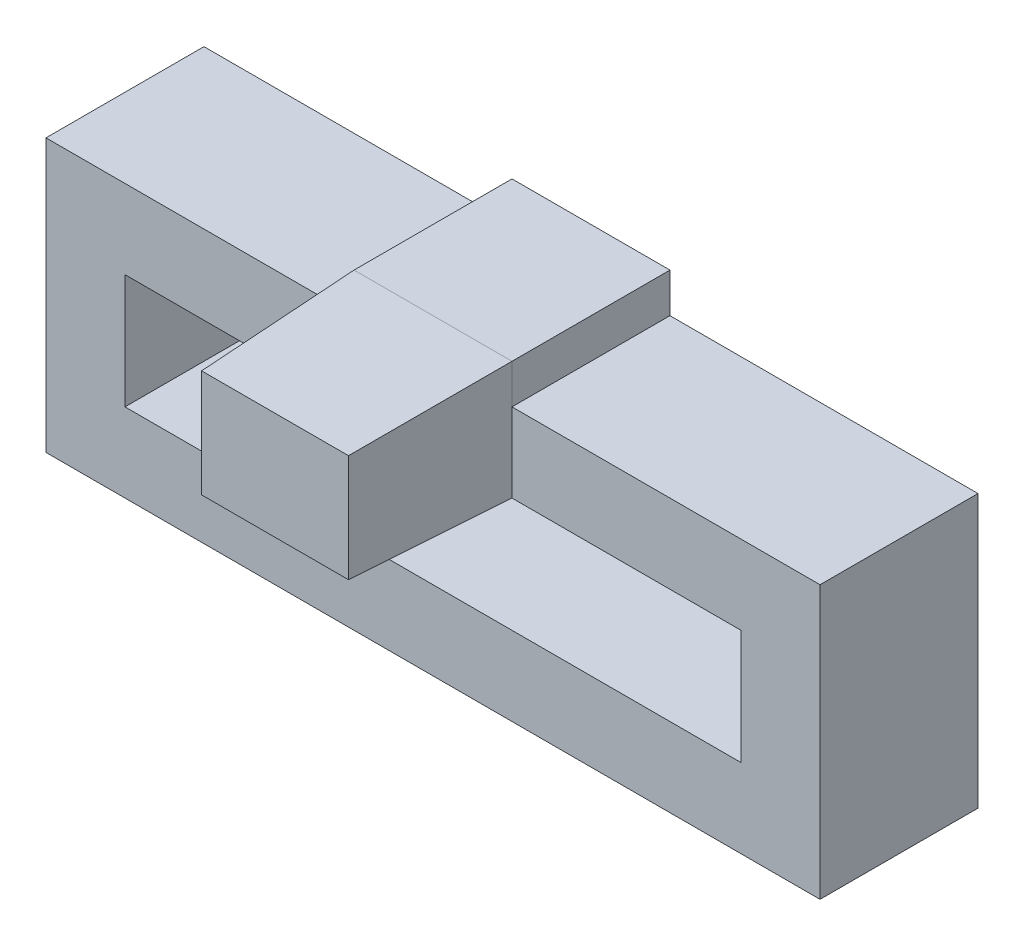
ISO-10303-21;
HEADER;
FILE_DESCRIPTION(('STEP AP214'),'2;1');
FILE_NAME('part.step','',(''),(''),'','','');
FILE_SCHEMA(('AUTOMOTIVE_DESIGN { 1 0 10303 214 1 1 1 1 }'));
ENDSEC;
DATA;
#1=APPLICATION_CONTEXT('core data for automotive mechanical design processes');
#2=APPLICATION_PROTOCOL_DEFINITION('international standard','automotive_design',2000,#1);
#3=PRODUCT_CONTEXT('',#1,'mechanical');
#4=PRODUCT('Part','Part','',(#3));
#5=PRODUCT_RELATED_PRODUCT_CATEGORY('part','',(#4));
#6=PRODUCT_DEFINITION_FORMATION('','',#4);
#7=PRODUCT_DEFINITION_CONTEXT('part definition',#1,'design');
#8=PRODUCT_DEFINITION('design','',#6,#7);
#9=PRODUCT_DEFINITION_SHAPE('','',#8);
#10=(LENGTH_UNIT() NAMED_UNIT(*) SI_UNIT(.MILLI.,.METRE.));
#11=(NAMED_UNIT(*) PLANE_ANGLE_UNIT() SI_UNIT($,.RADIAN.));
#12=(NAMED_UNIT(*) SI_UNIT($,.STERADIAN.) SOLID_ANGLE_UNIT());
#13=UNCERTAINTY_MEASURE_WITH_UNIT(LENGTH_MEASURE(1.E-05),#10,'distance_accuracy_value','');
#14=(GEOMETRIC_REPRESENTATION_CONTEXT(3) GLOBAL_UNCERTAINTY_ASSIGNED_CONTEXT((#13)) GLOBAL_UNIT_ASSIGNED_CONTEXT((#10,
#11,#12)) REPRESENTATION_CONTEXT('',''));
#15=CARTESIAN_POINT('',(0.,0.,0.));
#16=DIRECTION('',(0.,0.,1.));
#17=DIRECTION('',(1.,0.,0.));
#18=AXIS2_PLACEMENT_3D('',#15,#16,#17);
#19=CARTESIAN_POINT('',(0.,4.9,4.));
#20=DIRECTION('',(0.,-1.,0.));
#21=DIRECTION('',(0.,0.,-1.));
#22=AXIS2_PLACEMENT_3D('',#19,#20,#21);
#23=PLANE('',#22);
#24=DIRECTION('',(0.,0.,1.));
#25=VECTOR('',#24,1.);
#26=CARTESIAN_POINT('',(5.8,4.9,4.));
#27=LINE('',#26,#25);
#28=CARTESIAN_POINT('',(5.8,4.9,0.));
#29=VERTEX_POINT('',#28);
#30=CARTESIAN_POINT('',(5.8,4.9,4.));
#31=VERTEX_POINT('',#30);
#32=EDGE_CURVE('E221',#29,#31,#27,.T.);
#33=ORIENTED_EDGE('',*,*,#32,.F.);
#34=DIRECTION('',(-1.,0.,0.));
#35=VECTOR('',#34,1.);
#36=CARTESIAN_POINT('',(0.,4.9,0.));
#37=LINE('',#36,#35);
#38=CARTESIAN_POINT('',(-2.,4.9,0.));
#39=VERTEX_POINT('',#38);
#40=EDGE_CURVE('E275',#29,#39,#37,.T.);
#41=ORIENTED_EDGE('',*,*,#40,.T.);
#42=DIRECTION('',(0.,0.,-1.));
#43=VECTOR('',#42,1.);
#44=CARTESIAN_POINT('',(-2.,4.9,4.));
#45=LINE('',#44,#43);
#46=CARTESIAN_POINT('',(-2.,4.9,4.));
#47=VERTEX_POINT('',#46);
#48=EDGE_CURVE('E268',#47,#39,#45,.T.);
#49=ORIENTED_EDGE('',*,*,#48,.F.);
#50=DIRECTION('',(-1.,0.,0.));
#51=VECTOR('',#50,1.);
#52=CARTESIAN_POINT('',(0.,4.9,4.));
#53=LINE('',#52,#51);
#54=EDGE_CURVE('E264',#31,#47,#53,.T.);
#55=ORIENTED_EDGE('',*,*,#54,.F.);
#56=EDGE_LOOP('',(#33,#41,#49,#55));
#57=FACE_BOUND('',#56,.T.);
#58=ADVANCED_FACE('F63',(#57),#23,.F.);
#59=DIRECTION('',(0.,0.,-1.));
#60=VECTOR('',#59,1.);
#61=CARTESIAN_POINT('',(9.8,4.9,4.));
#62=LINE('',#61,#60);
#63=CARTESIAN_POINT('',(9.8,4.9,4.));
#64=VERTEX_POINT('',#63);
#65=CARTESIAN_POINT('',(9.8,4.9,0.));
#66=VERTEX_POINT('',#65);
#67=EDGE_CURVE('E204',#64,#66,#62,.T.);
#68=ORIENTED_EDGE('',*,*,#67,.F.);
#69=CARTESIAN_POINT('',(17.6,4.9,4.));
#70=VERTEX_POINT('',#69);
#71=EDGE_CURVE('E265',#70,#64,#53,.T.);
#72=ORIENTED_EDGE('',*,*,#71,.F.);
#73=DIRECTION('',(0.,0.,-1.));
#74=VECTOR('',#73,1.);
#75=CARTESIAN_POINT('',(17.6,4.9,4.));
#76=LINE('',#75,#74);
#77=CARTESIAN_POINT('',(17.6,4.9,0.));
#78=VERTEX_POINT('',#77);
#79=EDGE_CURVE('E279',#70,#78,#76,.T.);
#80=ORIENTED_EDGE('',*,*,#79,.T.);
#81=EDGE_CURVE('E88',#78,#66,#37,.T.);
#82=ORIENTED_EDGE('',*,*,#81,.T.);
#83=EDGE_LOOP('',(#68,#72,#80,#82));
#84=FACE_BOUND('',#83,.T.);
#85=ADVANCED_FACE('F329',(#84),#23,.F.);
#86=CARTESIAN_POINT('',(0.,0.,4.));
#87=DIRECTION('',(0.,0.,1.));
#88=DIRECTION('',(1.,0.,0.));
#89=AXIS2_PLACEMENT_3D('',#86,#87,#88);
#90=PLANE('',#89);
#91=DIRECTION('',(0.,-1.,0.));
#92=VECTOR('',#91,1.);
#93=CARTESIAN_POINT('',(5.8,5.9,4.));
#94=LINE('',#93,#92);
#95=CARTESIAN_POINT('',(5.8,2.9,4.));
#96=VERTEX_POINT('',#95);
#97=EDGE_CURVE('E12',#31,#96,#94,.T.);
#98=ORIENTED_EDGE('',*,*,#97,.F.);
#99=ORIENTED_EDGE('',*,*,#54,.T.);
#100=DIRECTION('',(0.,-1.,0.));
#101=VECTOR('',#100,1.);
#102=CARTESIAN_POINT('',(-2.,0.,4.));
#103=LINE('',#102,#101);
#104=CARTESIAN_POINT('',(-2.,-2.,4.));
#105=VERTEX_POINT('',#104);
#106=EDGE_CURVE('E257',#47,#105,#103,.T.);
#107=ORIENTED_EDGE('',*,*,#106,.T.);
#108=DIRECTION('',(1.,0.,0.));
#109=VECTOR('',#108,1.);
#110=CARTESIAN_POINT('',(0.,-2.,4.));
#111=LINE('',#110,#109);
#112=CARTESIAN_POINT('',(17.6,-2.,4.));
#113=VERTEX_POINT('',#112);
#114=EDGE_CURVE('E260',#105,#113,#111,.T.);
#115=ORIENTED_EDGE('',*,*,#114,.T.);
#116=DIRECTION('',(0.,1.,0.));
#117=VECTOR('',#116,1.);
#118=CARTESIAN_POINT('',(17.6,0.,4.));
#119=LINE('',#118,#117);
#120=EDGE_CURVE('E262',#113,#70,#119,.T.);
#121=ORIENTED_EDGE('',*,*,#120,.T.);
#122=ORIENTED_EDGE('',*,*,#71,.T.);
#123=DIRECTION('',(0.,-1.,0.));
#124=VECTOR('',#123,1.);
#125=CARTESIAN_POINT('',(9.8,5.9,4.));
#126=LINE('',#125,#124);
#127=CARTESIAN_POINT('',(9.8,2.9,4.));
#128=VERTEX_POINT('',#127);
#129=EDGE_CURVE('E72',#64,#128,#126,.T.);
#130=ORIENTED_EDGE('',*,*,#129,.T.);
#131=DIRECTION('',(-1.,0.,0.));
#132=VECTOR('',#131,1.);
#133=CARTESIAN_POINT('',(0.,2.9,4.));
#134=LINE('',#133,#132);
#135=CARTESIAN_POINT('',(15.6,2.9,4.));
#136=VERTEX_POINT('',#135);
#137=EDGE_CURVE('E234',#136,#128,#134,.T.);
#138=ORIENTED_EDGE('',*,*,#137,.F.);
#139=DIRECTION('',(0.,1.,0.));
#140=VECTOR('',#139,1.);
#141=CARTESIAN_POINT('',(15.6,0.,4.));
#142=LINE('',#141,#140);
#143=CARTESIAN_POINT('',(15.6,0.,4.));
#144=VERTEX_POINT('',#143);
#145=EDGE_CURVE('E230',#144,#136,#142,.T.);
#146=ORIENTED_EDGE('',*,*,#145,.F.);
#147=DIRECTION('',(1.,0.,0.));
#148=VECTOR('',#147,1.);
#149=CARTESIAN_POINT('',(0.,0.,4.));
#150=LINE('',#149,#148);
#151=CARTESIAN_POINT('',(0.,0.,4.));
#152=VERTEX_POINT('',#151);
#153=EDGE_CURVE('E227',#152,#144,#150,.T.);
#154=ORIENTED_EDGE('',*,*,#153,.F.);
#155=DIRECTION('',(0.,-1.,0.));
#156=VECTOR('',#155,1.);
#157=CARTESIAN_POINT('',(0.,0.,4.));
#158=LINE('',#157,#156);
#159=CARTESIAN_POINT('',(0.,2.9,4.));
#160=VERTEX_POINT('',#159);
#161=EDGE_CURVE('E225',#160,#152,#158,.T.);
#162=ORIENTED_EDGE('',*,*,#161,.F.);
#163=EDGE_CURVE('E233',#96,#160,#134,.T.);
#164=ORIENTED_EDGE('',*,*,#163,.F.);
#165=EDGE_LOOP('',(#98,#99,#107,#115,#121,#122,#130,#138,#146,#154,#162,#164));
#166=FACE_BOUND('',#165,.T.);
#167=ADVANCED_FACE('F312',(#166),#90,.T.);
#168=CARTESIAN_POINT('',(0.,0.,0.));
#169=DIRECTION('',(0.,0.,1.));
#170=DIRECTION('',(1.,0.,0.));
#171=AXIS2_PLACEMENT_3D('',#168,#169,#170);
#172=PLANE('',#171);
#173=ORIENTED_EDGE('',*,*,#40,.F.);
#174=DIRECTION('',(0.,-1.,0.));
#175=VECTOR('',#174,1.);
#176=CARTESIAN_POINT('',(5.8,2.9,0.));
#177=LINE('',#176,#175);
#178=CARTESIAN_POINT('',(5.8,5.9,0.));
#179=VERTEX_POINT('',#178);
#180=EDGE_CURVE('E214',#179,#29,#177,.T.);
#181=ORIENTED_EDGE('',*,*,#180,.F.);
#182=DIRECTION('',(-1.,0.,0.));
#183=VECTOR('',#182,1.);
#184=CARTESIAN_POINT('',(5.8,5.9,0.));
#185=LINE('',#184,#183);
#186=CARTESIAN_POINT('',(9.8,5.9,0.));
#187=VERTEX_POINT('',#186);
#188=EDGE_CURVE('E218',#187,#179,#185,.T.);
#189=ORIENTED_EDGE('',*,*,#188,.F.);
#190=DIRECTION('',(0.,1.,0.));
#191=VECTOR('',#190,1.);
#192=CARTESIAN_POINT('',(9.8,2.9,0.));
#193=LINE('',#192,#191);
#194=EDGE_CURVE('E201',#66,#187,#193,.T.);
#195=ORIENTED_EDGE('',*,*,#194,.F.);
#196=ORIENTED_EDGE('',*,*,#81,.F.);
#197=DIRECTION('',(0.,1.,0.));
#198=VECTOR('',#197,1.);
#199=CARTESIAN_POINT('',(17.6,0.,0.));
#200=LINE('',#199,#198);
#201=CARTESIAN_POINT('',(17.6,-2.,0.));
#202=VERTEX_POINT('',#201);
#203=EDGE_CURVE('E273',#202,#78,#200,.T.);
#204=ORIENTED_EDGE('',*,*,#203,.F.);
#205=DIRECTION('',(1.,0.,0.));
#206=VECTOR('',#205,1.);
#207=CARTESIAN_POINT('',(0.,-2.,0.));
#208=LINE('',#207,#206);
#209=CARTESIAN_POINT('',(-2.,-2.,0.));
#210=VERTEX_POINT('',#209);
#211=EDGE_CURVE('E271',#210,#202,#208,.T.);
#212=ORIENTED_EDGE('',*,*,#211,.F.);
#213=DIRECTION('',(0.,-1.,0.));
#214=VECTOR('',#213,1.);
#215=CARTESIAN_POINT('',(-2.,0.,0.));
#216=LINE('',#215,#214);
#217=EDGE_CURVE('E256',#39,#210,#216,.T.);
#218=ORIENTED_EDGE('',*,*,#217,.F.);
#219=EDGE_LOOP('',(#173,#181,#189,#195,#196,#204,#212,#218));
#220=FACE_BOUND('',#219,.T.);
#221=DIRECTION('',(-1.,0.,0.));
#222=VECTOR('',#221,1.);
#223=CARTESIAN_POINT('',(0.,2.9,0.));
#224=LINE('',#223,#222);
#225=CARTESIAN_POINT('',(15.6,2.9,0.));
#226=VERTEX_POINT('',#225);
#227=CARTESIAN_POINT('',(0.,2.9,0.));
#228=VERTEX_POINT('',#227);
#229=EDGE_CURVE('E228',#226,#228,#224,.T.);
#230=ORIENTED_EDGE('',*,*,#229,.T.);
#231=DIRECTION('',(0.,-1.,0.));
#232=VECTOR('',#231,1.);
#233=CARTESIAN_POINT('',(0.,0.,0.));
#234=LINE('',#233,#232);
#235=CARTESIAN_POINT('',(0.,0.,0.));
#236=VERTEX_POINT('',#235);
#237=EDGE_CURVE('E224',#228,#236,#234,.T.);
#238=ORIENTED_EDGE('',*,*,#237,.T.);
#239=DIRECTION('',(1.,0.,0.));
#240=VECTOR('',#239,1.);
#241=CARTESIAN_POINT('',(0.,0.,0.));
#242=LINE('',#241,#240);
#243=CARTESIAN_POINT('',(15.6,0.,0.));
#244=VERTEX_POINT('',#243);
#245=EDGE_CURVE('E240',#236,#244,#242,.T.);
#246=ORIENTED_EDGE('',*,*,#245,.T.);
#247=DIRECTION('',(0.,1.,0.));
#248=VECTOR('',#247,1.);
#249=CARTESIAN_POINT('',(15.6,0.,0.));
#250=LINE('',#249,#248);
#251=EDGE_CURVE('E243',#244,#226,#250,.T.);
#252=ORIENTED_EDGE('',*,*,#251,.T.);
#253=EDGE_LOOP('',(#230,#238,#246,#252));
#254=FACE_BOUND('',#253,.T.);
#255=ADVANCED_FACE('F321',(#220,#254),#172,.F.);
#256=CARTESIAN_POINT('',(-2.,0.,4.));
#257=DIRECTION('',(1.,0.,0.));
#258=DIRECTION('',(0.,0.,-1.));
#259=AXIS2_PLACEMENT_3D('',#256,#257,#258);
#260=PLANE('',#259);
#261=ORIENTED_EDGE('',*,*,#217,.T.);
#262=DIRECTION('',(0.,0.,-1.));
#263=VECTOR('',#262,1.);
#264=CARTESIAN_POINT('',(-2.,-2.,4.));
#265=LINE('',#264,#263);
#266=EDGE_CURVE('E67',#105,#210,#265,.T.);
#267=ORIENTED_EDGE('',*,*,#266,.F.);
#268=ORIENTED_EDGE('',*,*,#106,.F.);
#269=ORIENTED_EDGE('',*,*,#48,.T.);
#270=EDGE_LOOP('',(#261,#267,#268,#269));
#271=FACE_BOUND('',#270,.T.);
#272=ADVANCED_FACE('F65',(#271),#260,.F.);
#273=CARTESIAN_POINT('',(0.,-2.,4.));
#274=DIRECTION('',(0.,1.,0.));
#275=DIRECTION('',(0.,0.,1.));
#276=AXIS2_PLACEMENT_3D('',#273,#274,#275);
#277=PLANE('',#276);
#278=ORIENTED_EDGE('',*,*,#211,.T.);
#279=DIRECTION('',(0.,0.,-1.));
#280=VECTOR('',#279,1.);
#281=CARTESIAN_POINT('',(17.6,-2.,4.));
#282=LINE('',#281,#280);
#283=EDGE_CURVE('E280',#113,#202,#282,.T.);
#284=ORIENTED_EDGE('',*,*,#283,.F.);
#285=ORIENTED_EDGE('',*,*,#114,.F.);
#286=ORIENTED_EDGE('',*,*,#266,.T.);
#287=EDGE_LOOP('',(#278,#284,#285,#286));
#288=FACE_BOUND('',#287,.T.);
#289=ADVANCED_FACE('F326',(#288),#277,.F.);
#290=CARTESIAN_POINT('',(17.6,0.,4.));
#291=DIRECTION('',(-1.,0.,0.));
#292=DIRECTION('',(0.,0.,1.));
#293=AXIS2_PLACEMENT_3D('',#290,#291,#292);
#294=PLANE('',#293);
#295=ORIENTED_EDGE('',*,*,#203,.T.);
#296=ORIENTED_EDGE('',*,*,#79,.F.);
#297=ORIENTED_EDGE('',*,*,#120,.F.);
#298=ORIENTED_EDGE('',*,*,#283,.T.);
#299=EDGE_LOOP('',(#295,#296,#297,#298));
#300=FACE_BOUND('',#299,.T.);
#301=ADVANCED_FACE('F327',(#300),#294,.F.);
#302=CARTESIAN_POINT('',(0.,0.,4.));
#303=DIRECTION('',(1.,0.,0.));
#304=DIRECTION('',(0.,0.,-1.));
#305=AXIS2_PLACEMENT_3D('',#302,#303,#304);
#306=PLANE('',#305);
#307=ORIENTED_EDGE('',*,*,#237,.F.);
#308=DIRECTION('',(0.,0.,-1.));
#309=VECTOR('',#308,1.);
#310=CARTESIAN_POINT('',(0.,2.9,4.));
#311=LINE('',#310,#309);
#312=EDGE_CURVE('E237',#160,#228,#311,.T.);
#313=ORIENTED_EDGE('',*,*,#312,.F.);
#314=ORIENTED_EDGE('',*,*,#161,.T.);
#315=DIRECTION('',(0.,0.,-1.));
#316=VECTOR('',#315,1.);
#317=CARTESIAN_POINT('',(0.,0.,4.));
#318=LINE('',#317,#316);
#319=EDGE_CURVE('E253',#152,#236,#318,.T.);
#320=ORIENTED_EDGE('',*,*,#319,.T.);
#321=EDGE_LOOP('',(#307,#313,#314,#320));
#322=FACE_BOUND('',#321,.T.);
#323=ADVANCED_FACE('F340',(#322),#306,.T.);
#324=CARTESIAN_POINT('',(0.,0.,4.));
#325=DIRECTION('',(0.,1.,0.));
#326=DIRECTION('',(0.,0.,1.));
#327=AXIS2_PLACEMENT_3D('',#324,#325,#326);
#328=PLANE('',#327);
#329=ORIENTED_EDGE('',*,*,#245,.F.);
#330=ORIENTED_EDGE('',*,*,#319,.F.);
#331=ORIENTED_EDGE('',*,*,#153,.T.);
#332=DIRECTION('',(0.,0.,-1.));
#333=VECTOR('',#332,1.);
#334=CARTESIAN_POINT('',(15.6,0.,4.));
#335=LINE('',#334,#333);
#336=EDGE_CURVE('E251',#144,#244,#335,.T.);
#337=ORIENTED_EDGE('',*,*,#336,.T.);
#338=EDGE_LOOP('',(#329,#330,#331,#337));
#339=FACE_BOUND('',#338,.T.);
#340=ADVANCED_FACE('F446',(#339),#328,.T.);
#341=CARTESIAN_POINT('',(15.6,0.,4.));
#342=DIRECTION('',(-1.,0.,0.));
#343=DIRECTION('',(0.,0.,1.));
#344=AXIS2_PLACEMENT_3D('',#341,#342,#343);
#345=PLANE('',#344);
#346=ORIENTED_EDGE('',*,*,#251,.F.);
#347=ORIENTED_EDGE('',*,*,#336,.F.);
#348=ORIENTED_EDGE('',*,*,#145,.T.);
#349=DIRECTION('',(0.,0.,-1.));
#350=VECTOR('',#349,1.);
#351=CARTESIAN_POINT('',(15.6,2.9,4.));
#352=LINE('',#351,#350);
#353=EDGE_CURVE('E249',#136,#226,#352,.T.);
#354=ORIENTED_EDGE('',*,*,#353,.T.);
#355=EDGE_LOOP('',(#346,#347,#348,#354));
#356=FACE_BOUND('',#355,.T.);
#357=ADVANCED_FACE('F370',(#356),#345,.T.);
#358=CARTESIAN_POINT('',(0.,2.9,4.));
#359=DIRECTION('',(0.,-1.,0.));
#360=DIRECTION('',(0.,0.,-1.));
#361=AXIS2_PLACEMENT_3D('',#358,#359,#360);
#362=PLANE('',#361);
#363=ORIENTED_EDGE('',*,*,#137,.T.);
#364=DIRECTION('',(1.,0.,0.));
#365=VECTOR('',#364,1.);
#366=CARTESIAN_POINT('',(5.8,2.9,4.));
#367=LINE('',#366,#365);
#368=EDGE_CURVE('E80',#96,#128,#367,.T.);
#369=ORIENTED_EDGE('',*,*,#368,.F.);
#370=ORIENTED_EDGE('',*,*,#163,.T.);
#371=ORIENTED_EDGE('',*,*,#312,.T.);
#372=ORIENTED_EDGE('',*,*,#229,.F.);
#373=ORIENTED_EDGE('',*,*,#353,.F.);
#374=EDGE_LOOP('',(#363,#369,#370,#371,#372,#373));
#375=FACE_BOUND('',#374,.T.);
#376=ADVANCED_FACE('F365',(#375),#362,.T.);
#377=CARTESIAN_POINT('',(5.8,2.9,4.));
#378=DIRECTION('',(1.,0.,0.));
#379=DIRECTION('',(0.,0.,-1.));
#380=AXIS2_PLACEMENT_3D('',#377,#378,#379);
#381=PLANE('',#380);
#382=ORIENTED_EDGE('',*,*,#180,.T.);
#383=ORIENTED_EDGE('',*,*,#32,.T.);
#384=DIRECTION('',(0.,-1.,0.));
#385=VECTOR('',#384,1.);
#386=CARTESIAN_POINT('',(5.8,2.9,4.));
#387=LINE('',#386,#385);
#388=CARTESIAN_POINT('',(5.8,5.9,4.));
#389=VERTEX_POINT('',#388);
#390=EDGE_CURVE('E195',#389,#31,#387,.T.);
#391=ORIENTED_EDGE('',*,*,#390,.F.);
#392=DIRECTION('',(0.,0.,-1.));
#393=VECTOR('',#392,1.);
#394=CARTESIAN_POINT('',(5.8,5.9,4.));
#395=LINE('',#394,#393);
#396=EDGE_CURVE('E205',#389,#179,#395,.T.);
#397=ORIENTED_EDGE('',*,*,#396,.T.);
#398=EDGE_LOOP('',(#382,#383,#391,#397));
#399=FACE_BOUND('',#398,.T.);
#400=ADVANCED_FACE('F318',(#399),#381,.F.);
#401=CARTESIAN_POINT('',(9.8,2.9,4.));
#402=DIRECTION('',(-1.,0.,0.));
#403=DIRECTION('',(0.,-1.,0.));
#404=AXIS2_PLACEMENT_3D('',#401,#402,#403);
#405=PLANE('',#404);
#406=DIRECTION('',(0.,1.,0.));
#407=VECTOR('',#406,1.);
#408=CARTESIAN_POINT('',(9.8,2.9,4.));
#409=LINE('',#408,#407);
#410=CARTESIAN_POINT('',(9.8,5.9,4.));
#411=VERTEX_POINT('',#410);
#412=EDGE_CURVE('E190',#64,#411,#409,.T.);
#413=ORIENTED_EDGE('',*,*,#412,.F.);
#414=ORIENTED_EDGE('',*,*,#67,.T.);
#415=ORIENTED_EDGE('',*,*,#194,.T.);
#416=DIRECTION('',(0.,0.,-1.));
#417=VECTOR('',#416,1.);
#418=CARTESIAN_POINT('',(9.8,5.9,4.));
#419=LINE('',#418,#417);
#420=EDGE_CURVE('E198',#411,#187,#419,.T.);
#421=ORIENTED_EDGE('',*,*,#420,.F.);
#422=EDGE_LOOP('',(#413,#414,#415,#421));
#423=FACE_BOUND('',#422,.T.);
#424=ADVANCED_FACE('F199',(#423),#405,.F.);
#425=CARTESIAN_POINT('',(5.8,5.9,4.));
#426=DIRECTION('',(0.,-1.,0.));
#427=DIRECTION('',(1.,0.,0.));
#428=AXIS2_PLACEMENT_3D('',#425,#426,#427);
#429=PLANE('',#428);
#430=ORIENTED_EDGE('',*,*,#188,.T.);
#431=ORIENTED_EDGE('',*,*,#396,.F.);
#432=DIRECTION('',(-1.,0.,0.));
#433=VECTOR('',#432,1.);
#434=CARTESIAN_POINT('',(5.8,5.9,4.));
#435=LINE('',#434,#433);
#436=EDGE_CURVE('E179',#411,#389,#435,.T.);
#437=ORIENTED_EDGE('',*,*,#436,.F.);
#438=ORIENTED_EDGE('',*,*,#420,.T.);
#439=EDGE_LOOP('',(#430,#431,#437,#438));
#440=FACE_BOUND('',#439,.T.);
#441=ADVANCED_FACE('F207',(#440),#429,.F.);
#442=CARTESIAN_POINT('',(5.8,2.9,4.));
#443=DIRECTION('',(0.,-0.999390827019096,0.034899496702501));
#444=DIRECTION('',(0.,-0.034899496702501,-0.999390827019096));
#445=AXIS2_PLACEMENT_3D('',#442,#443,#444);
#446=PLANE('',#445);
#447=ORIENTED_EDGE('',*,*,#368,.T.);
#448=DIRECTION('',(-0.0348782627423747,0.0348782627423747,0.998782765958718));
#449=VECTOR('',#448,1.);
#450=CARTESIAN_POINT('',(9.7951340271523,2.9048659728477,4.13934323093466));
#451=LINE('',#450,#449);
#452=CARTESIAN_POINT('',(9.66031692203301,3.03968307796699,8.));
#453=VERTEX_POINT('',#452);
#454=EDGE_CURVE('E186',#453,#128,#451,.F.);
#455=ORIENTED_EDGE('',*,*,#454,.F.);
#456=DIRECTION('',(-1.,0.,0.));
#457=VECTOR('',#456,1.);
#458=CARTESIAN_POINT('',(0.,3.03968307796699,8.));
#459=LINE('',#458,#457);
#460=CARTESIAN_POINT('',(5.93968307796699,3.03968307796699,8.));
#461=VERTEX_POINT('',#460);
#462=EDGE_CURVE('E299',#461,#453,#459,.F.);
#463=ORIENTED_EDGE('',*,*,#462,.F.);
#464=DIRECTION('',(-0.0348782627423747,-0.0348782627423747,-0.998782765958718));
#465=VECTOR('',#464,1.);
#466=CARTESIAN_POINT('',(5.8,2.9,4.));
#467=LINE('',#466,#465);
#468=EDGE_CURVE('E295',#461,#96,#467,.T.);
#469=ORIENTED_EDGE('',*,*,#468,.T.);
#470=EDGE_LOOP('',(#447,#455,#463,#469));
#471=FACE_BOUND('',#470,.T.);
#472=ADVANCED_FACE('F398',(#471),#446,.T.);
#473=CARTESIAN_POINT('',(9.8,5.9,4.));
#474=DIRECTION('',(0.999390827019096,0.,0.034899496702501));
#475=DIRECTION('',(0.034899496702501,0.,-0.999390827019096));
#476=AXIS2_PLACEMENT_3D('',#473,#474,#475);
#477=PLANE('',#476);
#478=ORIENTED_EDGE('',*,*,#412,.T.);
#479=DIRECTION('',(0.0348782627423747,0.0348782627423747,-0.998782765958718));
#480=VECTOR('',#479,1.);
#481=CARTESIAN_POINT('',(9.7951340271523,5.8951340271523,4.13934323093466));
#482=LINE('',#481,#480);
#483=CARTESIAN_POINT('',(9.66031692203301,5.76031692203301,8.));
#484=VERTEX_POINT('',#483);
#485=EDGE_CURVE('E175',#484,#411,#482,.T.);
#486=ORIENTED_EDGE('',*,*,#485,.F.);
#487=DIRECTION('',(0.,-1.,0.));
#488=VECTOR('',#487,1.);
#489=CARTESIAN_POINT('',(9.66031692203301,0.,8.));
#490=LINE('',#489,#488);
#491=EDGE_CURVE('E301',#484,#453,#490,.T.);
#492=ORIENTED_EDGE('',*,*,#491,.T.);
#493=ORIENTED_EDGE('',*,*,#454,.T.);
#494=ORIENTED_EDGE('',*,*,#129,.F.);
#495=EDGE_LOOP('',(#478,#486,#492,#493,#494));
#496=FACE_BOUND('',#495,.T.);
#497=ADVANCED_FACE('F192',(#496),#477,.T.);
#498=CARTESIAN_POINT('',(5.8,5.9,4.));
#499=DIRECTION('',(0.,0.999390827019096,0.034899496702501));
#500=DIRECTION('',(0.,-0.034899496702501,0.999390827019096));
#501=AXIS2_PLACEMENT_3D('',#498,#499,#500);
#502=PLANE('',#501);
#503=ORIENTED_EDGE('',*,*,#436,.T.);
#504=DIRECTION('',(0.0348782627423747,-0.0348782627423747,0.998782765958718));
#505=VECTOR('',#504,1.);
#506=CARTESIAN_POINT('',(5.8,5.9,4.));
#507=LINE('',#506,#505);
#508=CARTESIAN_POINT('',(5.93968307796699,5.76031692203301,8.));
#509=VERTEX_POINT('',#508);
#510=EDGE_CURVE('E187',#509,#389,#507,.F.);
#511=ORIENTED_EDGE('',*,*,#510,.F.);
#512=DIRECTION('',(1.,0.,0.));
#513=VECTOR('',#512,1.);
#514=CARTESIAN_POINT('',(0.,5.76031692203301,8.));
#515=LINE('',#514,#513);
#516=EDGE_CURVE('E182',#509,#484,#515,.T.);
#517=ORIENTED_EDGE('',*,*,#516,.T.);
#518=ORIENTED_EDGE('',*,*,#485,.T.);
#519=EDGE_LOOP('',(#503,#511,#517,#518));
#520=FACE_BOUND('',#519,.T.);
#521=ADVANCED_FACE('F177',(#520),#502,.T.);
#522=CARTESIAN_POINT('',(5.8,5.9,4.));
#523=DIRECTION('',(-0.999390827019096,0.,0.034899496702501));
#524=DIRECTION('',(0.034899496702501,0.,0.999390827019096));
#525=AXIS2_PLACEMENT_3D('',#522,#523,#524);
#526=PLANE('',#525);
#527=ORIENTED_EDGE('',*,*,#390,.T.);
#528=ORIENTED_EDGE('',*,*,#97,.T.);
#529=ORIENTED_EDGE('',*,*,#468,.F.);
#530=DIRECTION('',(0.,1.,0.));
#531=VECTOR('',#530,1.);
#532=CARTESIAN_POINT('',(5.93968307796699,0.,8.));
#533=LINE('',#532,#531);
#534=EDGE_CURVE('E297',#509,#461,#533,.F.);
#535=ORIENTED_EDGE('',*,*,#534,.F.);
#536=ORIENTED_EDGE('',*,*,#510,.T.);
#537=EDGE_LOOP('',(#527,#528,#529,#535,#536));
#538=FACE_BOUND('',#537,.T.);
#539=ADVANCED_FACE('F306',(#538),#526,.T.);
#540=CARTESIAN_POINT('',(0.,0.,8.));
#541=DIRECTION('',(0.,0.,-1.));
#542=DIRECTION('',(-1.,0.,0.));
#543=AXIS2_PLACEMENT_3D('',#540,#541,#542);
#544=PLANE('',#543);
#545=ORIENTED_EDGE('',*,*,#462,.T.);
#546=ORIENTED_EDGE('',*,*,#491,.F.);
#547=ORIENTED_EDGE('',*,*,#516,.F.);
#548=ORIENTED_EDGE('',*,*,#534,.T.);
#549=EDGE_LOOP('',(#545,#546,#547,#548));
#550=FACE_BOUND('',#549,.T.);
#551=ADVANCED_FACE('F431',(#550),#544,.F.);
#552=CLOSED_SHELL('',(#58,#85,#167,#255,#272,#289,#301,#323,#340,#357,#376,#400,#424,#441,#472,
#497,#521,#539,#551));
#553=MANIFOLD_SOLID_BREP('B2',#552);
#554=ADVANCED_BREP_SHAPE_REPRESENTATION('',(#18,#553),#14);
#555=SHAPE_DEFINITION_REPRESENTATION(#9,#554);
ENDSEC;
END-ISO-10303-21;
